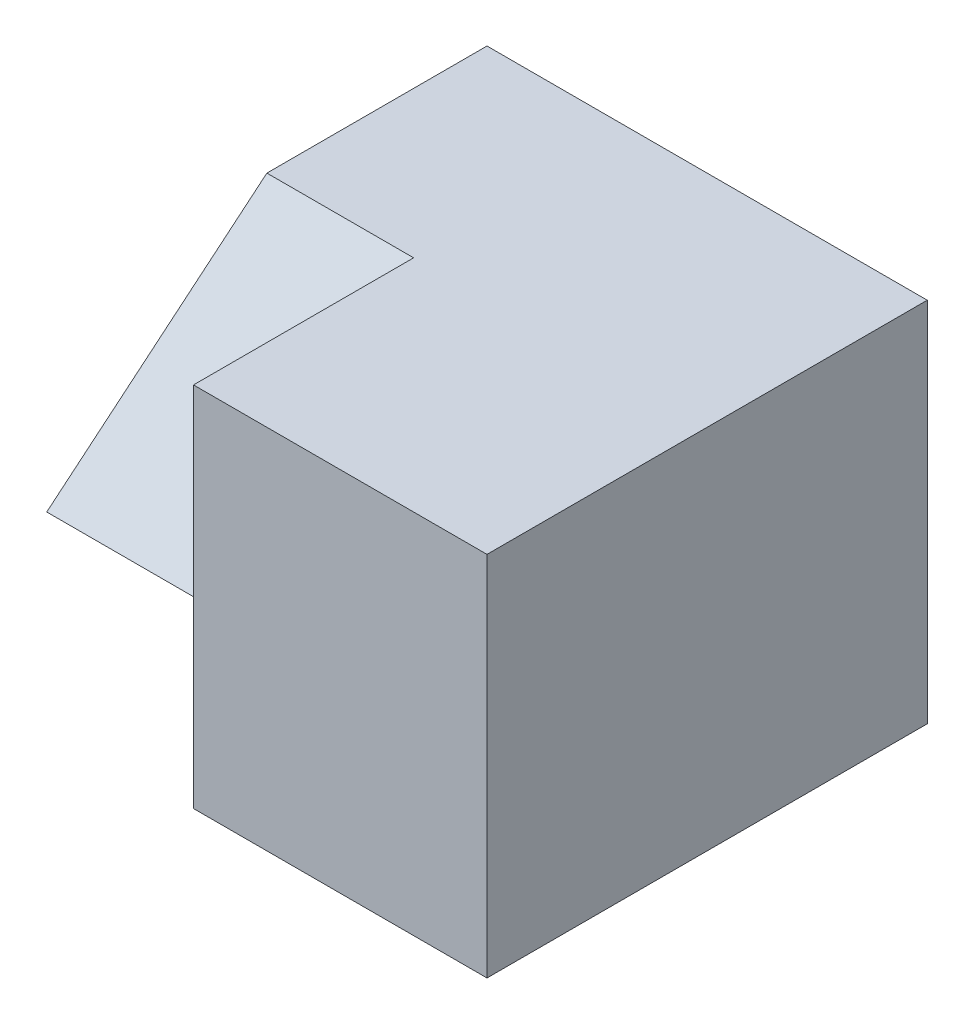
ISO-10303-21;
HEADER;
FILE_DESCRIPTION(('STEP AP214'),'2;1');
FILE_NAME('part.step','',(''),(''),'','','');
FILE_SCHEMA(('AUTOMOTIVE_DESIGN { 1 0 10303 214 1 1 1 1 }'));
ENDSEC;
DATA;
#1=APPLICATION_CONTEXT('core data for automotive mechanical design processes');
#2=APPLICATION_PROTOCOL_DEFINITION('international standard','automotive_design',2000,#1);
#3=PRODUCT_CONTEXT('',#1,'mechanical');
#4=PRODUCT('Part','Part','',(#3));
#5=PRODUCT_RELATED_PRODUCT_CATEGORY('part','',(#4));
#6=PRODUCT_DEFINITION_FORMATION('','',#4);
#7=PRODUCT_DEFINITION_CONTEXT('part definition',#1,'design');
#8=PRODUCT_DEFINITION('design','',#6,#7);
#9=PRODUCT_DEFINITION_SHAPE('','',#8);
#10=(LENGTH_UNIT() NAMED_UNIT(*) SI_UNIT(.MILLI.,.METRE.));
#11=(NAMED_UNIT(*) PLANE_ANGLE_UNIT() SI_UNIT($,.RADIAN.));
#12=(NAMED_UNIT(*) SI_UNIT($,.STERADIAN.) SOLID_ANGLE_UNIT());
#13=UNCERTAINTY_MEASURE_WITH_UNIT(LENGTH_MEASURE(1.E-05),#10,'distance_accuracy_value','');
#14=(GEOMETRIC_REPRESENTATION_CONTEXT(3) GLOBAL_UNCERTAINTY_ASSIGNED_CONTEXT((#13)) GLOBAL_UNIT_ASSIGNED_CONTEXT((#10,
#11,#12)) REPRESENTATION_CONTEXT('',''));
#15=CARTESIAN_POINT('',(0.,0.,0.));
#16=DIRECTION('',(0.,0.,1.));
#17=DIRECTION('',(1.,0.,0.));
#18=AXIS2_PLACEMENT_3D('',#15,#16,#17);
#19=CARTESIAN_POINT('',(-3.,5.,3.));
#20=DIRECTION('',(0.,0.,-1.));
#21=DIRECTION('',(-1.,0.,0.));
#22=AXIS2_PLACEMENT_3D('',#19,#20,#21);
#23=PLANE('',#22);
#24=DIRECTION('',(0.,1.,0.));
#25=VECTOR('',#24,1.);
#26=CARTESIAN_POINT('',(-1.,0.,3.));
#27=LINE('',#26,#25);
#28=CARTESIAN_POINT('',(-1.,0.,3.));
#29=VERTEX_POINT('',#28);
#30=CARTESIAN_POINT('',(-1.,2.5,3.));
#31=VERTEX_POINT('',#30);
#32=EDGE_CURVE('E119',#29,#31,#27,.T.);
#33=ORIENTED_EDGE('',*,*,#32,.F.);
#34=DIRECTION('',(1.,0.,0.));
#35=VECTOR('',#34,1.);
#36=CARTESIAN_POINT('',(-3.,0.,3.));
#37=LINE('',#36,#35);
#38=CARTESIAN_POINT('',(3.,0.,3.));
#39=VERTEX_POINT('',#38);
#40=EDGE_CURVE('E74',#29,#39,#37,.T.);
#41=ORIENTED_EDGE('',*,*,#40,.T.);
#42=DIRECTION('',(0.,-1.,0.));
#43=VECTOR('',#42,1.);
#44=CARTESIAN_POINT('',(3.,5.,3.));
#45=LINE('',#44,#43);
#46=CARTESIAN_POINT('',(3.,5.,3.));
#47=VERTEX_POINT('',#46);
#48=EDGE_CURVE('E146',#47,#39,#45,.T.);
#49=ORIENTED_EDGE('',*,*,#48,.F.);
#50=DIRECTION('',(1.,0.,0.));
#51=VECTOR('',#50,1.);
#52=CARTESIAN_POINT('',(-3.,5.,3.));
#53=LINE('',#52,#51);
#54=CARTESIAN_POINT('',(-1.,5.,3.));
#55=VERTEX_POINT('',#54);
#56=EDGE_CURVE('E56',#55,#47,#53,.T.);
#57=ORIENTED_EDGE('',*,*,#56,.F.);
#58=DIRECTION('',(0.,1.,0.));
#59=VECTOR('',#58,1.);
#60=CARTESIAN_POINT('',(-1.,0.,3.));
#61=LINE('',#60,#59);
#62=EDGE_CURVE('E48',#31,#55,#61,.T.);
#63=ORIENTED_EDGE('',*,*,#62,.F.);
#64=EDGE_LOOP('',(#33,#41,#49,#57,#63));
#65=FACE_BOUND('',#64,.T.);
#66=ADVANCED_FACE('F33',(#65),#23,.F.);
#67=CARTESIAN_POINT('',(3.,5.,3.));
#68=DIRECTION('',(-1.,0.,0.));
#69=DIRECTION('',(0.,0.,1.));
#70=AXIS2_PLACEMENT_3D('',#67,#68,#69);
#71=PLANE('',#70);
#72=DIRECTION('',(0.,0.,-1.));
#73=VECTOR('',#72,1.);
#74=CARTESIAN_POINT('',(3.,0.,3.));
#75=LINE('',#74,#73);
#76=CARTESIAN_POINT('',(3.,0.,-3.));
#77=VERTEX_POINT('',#76);
#78=EDGE_CURVE('E137',#39,#77,#75,.T.);
#79=ORIENTED_EDGE('',*,*,#78,.T.);
#80=DIRECTION('',(0.,-1.,0.));
#81=VECTOR('',#80,1.);
#82=CARTESIAN_POINT('',(3.,5.,-3.));
#83=LINE('',#82,#81);
#84=CARTESIAN_POINT('',(3.,5.,-3.));
#85=VERTEX_POINT('',#84);
#86=EDGE_CURVE('E11',#85,#77,#83,.T.);
#87=ORIENTED_EDGE('',*,*,#86,.F.);
#88=DIRECTION('',(0.,0.,-1.));
#89=VECTOR('',#88,1.);
#90=CARTESIAN_POINT('',(3.,5.,3.));
#91=LINE('',#90,#89);
#92=EDGE_CURVE('E139',#47,#85,#91,.T.);
#93=ORIENTED_EDGE('',*,*,#92,.F.);
#94=ORIENTED_EDGE('',*,*,#48,.T.);
#95=EDGE_LOOP('',(#79,#87,#93,#94));
#96=FACE_BOUND('',#95,.T.);
#97=ADVANCED_FACE('F35',(#96),#71,.F.);
#98=CARTESIAN_POINT('',(-3.,5.,-3.));
#99=DIRECTION('',(0.,0.,1.));
#100=DIRECTION('',(1.,0.,0.));
#101=AXIS2_PLACEMENT_3D('',#98,#99,#100);
#102=PLANE('',#101);
#103=DIRECTION('',(-1.,0.,0.));
#104=VECTOR('',#103,1.);
#105=CARTESIAN_POINT('',(-3.,0.,-3.));
#106=LINE('',#105,#104);
#107=CARTESIAN_POINT('',(-3.,0.,-3.));
#108=VERTEX_POINT('',#107);
#109=EDGE_CURVE('E149',#77,#108,#106,.T.);
#110=ORIENTED_EDGE('',*,*,#109,.T.);
#111=DIRECTION('',(0.,-1.,0.));
#112=VECTOR('',#111,1.);
#113=CARTESIAN_POINT('',(-3.,5.,-3.));
#114=LINE('',#113,#112);
#115=CARTESIAN_POINT('',(-3.,5.,-3.));
#116=VERTEX_POINT('',#115);
#117=EDGE_CURVE('E41',#116,#108,#114,.T.);
#118=ORIENTED_EDGE('',*,*,#117,.F.);
#119=DIRECTION('',(-1.,0.,0.));
#120=VECTOR('',#119,1.);
#121=CARTESIAN_POINT('',(-3.,5.,-3.));
#122=LINE('',#121,#120);
#123=EDGE_CURVE('E79',#85,#116,#122,.T.);
#124=ORIENTED_EDGE('',*,*,#123,.F.);
#125=ORIENTED_EDGE('',*,*,#86,.T.);
#126=EDGE_LOOP('',(#110,#118,#124,#125));
#127=FACE_BOUND('',#126,.T.);
#128=ADVANCED_FACE('F160',(#127),#102,.F.);
#129=CARTESIAN_POINT('',(-3.,5.,3.));
#130=DIRECTION('',(1.,0.,0.));
#131=DIRECTION('',(0.,0.,-1.));
#132=AXIS2_PLACEMENT_3D('',#129,#130,#131);
#133=PLANE('',#132);
#134=DIRECTION('',(0.,0.,1.));
#135=VECTOR('',#134,1.);
#136=CARTESIAN_POINT('',(-3.,0.,3.));
#137=LINE('',#136,#135);
#138=CARTESIAN_POINT('',(-3.,0.,0.));
#139=VERTEX_POINT('',#138);
#140=EDGE_CURVE('E151',#108,#139,#137,.T.);
#141=ORIENTED_EDGE('',*,*,#140,.T.);
#142=DIRECTION('',(0.,-0.64018439966448,-0.768221279597376));
#143=VECTOR('',#142,1.);
#144=CARTESIAN_POINT('',(-3.,0.,0.));
#145=LINE('',#144,#143);
#146=CARTESIAN_POINT('',(-3.,2.5,3.));
#147=VERTEX_POINT('',#146);
#148=EDGE_CURVE('E109',#147,#139,#145,.T.);
#149=ORIENTED_EDGE('',*,*,#148,.F.);
#150=DIRECTION('',(0.,-0.64018439966448,0.768221279597376));
#151=VECTOR('',#150,1.);
#152=CARTESIAN_POINT('',(-3.,2.95081967213115,2.45901639344262));
#153=LINE('',#152,#151);
#154=CARTESIAN_POINT('',(-3.,5.,0.));
#155=VERTEX_POINT('',#154);
#156=EDGE_CURVE('E114',#155,#147,#153,.T.);
#157=ORIENTED_EDGE('',*,*,#156,.F.);
#158=DIRECTION('',(0.,0.,1.));
#159=VECTOR('',#158,1.);
#160=CARTESIAN_POINT('',(-3.,5.,3.));
#161=LINE('',#160,#159);
#162=EDGE_CURVE('E142',#116,#155,#161,.T.);
#163=ORIENTED_EDGE('',*,*,#162,.F.);
#164=ORIENTED_EDGE('',*,*,#117,.T.);
#165=EDGE_LOOP('',(#141,#149,#157,#163,#164));
#166=FACE_BOUND('',#165,.T.);
#167=ADVANCED_FACE('F157',(#166),#133,.F.);
#168=CARTESIAN_POINT('',(0.,5.,0.));
#169=DIRECTION('',(0.,-1.,0.));
#170=DIRECTION('',(0.,0.,-1.));
#171=AXIS2_PLACEMENT_3D('',#168,#169,#170);
#172=PLANE('',#171);
#173=ORIENTED_EDGE('',*,*,#162,.T.);
#174=DIRECTION('',(-1.,0.,0.));
#175=VECTOR('',#174,1.);
#176=CARTESIAN_POINT('',(-1.,5.,0.));
#177=LINE('',#176,#175);
#178=CARTESIAN_POINT('',(-1.,5.,0.));
#179=VERTEX_POINT('',#178);
#180=EDGE_CURVE('E132',#179,#155,#177,.T.);
#181=ORIENTED_EDGE('',*,*,#180,.F.);
#182=DIRECTION('',(0.,0.,-1.));
#183=VECTOR('',#182,1.);
#184=CARTESIAN_POINT('',(-1.,5.,0.));
#185=LINE('',#184,#183);
#186=EDGE_CURVE('E127',#55,#179,#185,.T.);
#187=ORIENTED_EDGE('',*,*,#186,.F.);
#188=ORIENTED_EDGE('',*,*,#56,.T.);
#189=ORIENTED_EDGE('',*,*,#92,.T.);
#190=ORIENTED_EDGE('',*,*,#123,.T.);
#191=EDGE_LOOP('',(#173,#181,#187,#188,#189,#190));
#192=FACE_BOUND('',#191,.T.);
#193=ADVANCED_FACE('F172',(#192),#172,.F.);
#194=CARTESIAN_POINT('',(0.,0.,0.));
#195=DIRECTION('',(0.,-1.,0.));
#196=DIRECTION('',(0.,0.,-1.));
#197=AXIS2_PLACEMENT_3D('',#194,#195,#196);
#198=PLANE('',#197);
#199=DIRECTION('',(-1.,0.,0.));
#200=VECTOR('',#199,1.);
#201=CARTESIAN_POINT('',(-1.,0.,0.));
#202=LINE('',#201,#200);
#203=CARTESIAN_POINT('',(-1.,0.,0.));
#204=VERTEX_POINT('',#203);
#205=EDGE_CURVE('E103',#204,#139,#202,.T.);
#206=ORIENTED_EDGE('',*,*,#205,.T.);
#207=ORIENTED_EDGE('',*,*,#140,.F.);
#208=ORIENTED_EDGE('',*,*,#109,.F.);
#209=ORIENTED_EDGE('',*,*,#78,.F.);
#210=ORIENTED_EDGE('',*,*,#40,.F.);
#211=DIRECTION('',(0.,0.,1.));
#212=VECTOR('',#211,1.);
#213=CARTESIAN_POINT('',(-1.,0.,0.));
#214=LINE('',#213,#212);
#215=EDGE_CURVE('E115',#204,#29,#214,.T.);
#216=ORIENTED_EDGE('',*,*,#215,.F.);
#217=EDGE_LOOP('',(#206,#207,#208,#209,#210,#216));
#218=FACE_BOUND('',#217,.T.);
#219=ADVANCED_FACE('F121',(#218),#198,.T.);
#220=CARTESIAN_POINT('',(-1.,2.95081967213115,2.45901639344262));
#221=DIRECTION('',(0.,-0.768221279597376,-0.64018439966448));
#222=DIRECTION('',(0.,0.64018439966448,-0.768221279597376));
#223=AXIS2_PLACEMENT_3D('',#220,#221,#222);
#224=PLANE('',#223);
#225=ORIENTED_EDGE('',*,*,#156,.T.);
#226=DIRECTION('',(-1.,0.,0.));
#227=VECTOR('',#226,1.);
#228=CARTESIAN_POINT('',(-1.,2.5,3.));
#229=LINE('',#228,#227);
#230=EDGE_CURVE('E135',#31,#147,#229,.T.);
#231=ORIENTED_EDGE('',*,*,#230,.F.);
#232=DIRECTION('',(0.,-0.64018439966448,0.768221279597376));
#233=VECTOR('',#232,1.);
#234=CARTESIAN_POINT('',(-1.,2.95081967213115,2.45901639344262));
#235=LINE('',#234,#233);
#236=EDGE_CURVE('E129',#179,#31,#235,.T.);
#237=ORIENTED_EDGE('',*,*,#236,.F.);
#238=ORIENTED_EDGE('',*,*,#180,.T.);
#239=EDGE_LOOP('',(#225,#231,#237,#238));
#240=FACE_BOUND('',#239,.T.);
#241=ADVANCED_FACE('F193',(#240),#224,.F.);
#242=CARTESIAN_POINT('',(-1.,0.,0.));
#243=DIRECTION('',(-1.,0.,0.));
#244=DIRECTION('',(0.,0.,1.));
#245=AXIS2_PLACEMENT_3D('',#242,#243,#244);
#246=PLANE('',#245);
#247=ORIENTED_EDGE('',*,*,#186,.T.);
#248=ORIENTED_EDGE('',*,*,#236,.T.);
#249=ORIENTED_EDGE('',*,*,#62,.T.);
#250=EDGE_LOOP('',(#247,#248,#249));
#251=FACE_BOUND('',#250,.T.);
#252=ADVANCED_FACE('F199',(#251),#246,.T.);
#253=CARTESIAN_POINT('',(-1.,0.,0.));
#254=DIRECTION('',(0.,0.768221279597376,-0.64018439966448));
#255=DIRECTION('',(0.,0.64018439966448,0.768221279597376));
#256=AXIS2_PLACEMENT_3D('',#253,#254,#255);
#257=PLANE('',#256);
#258=ORIENTED_EDGE('',*,*,#148,.T.);
#259=ORIENTED_EDGE('',*,*,#205,.F.);
#260=DIRECTION('',(0.,-0.64018439966448,-0.768221279597376));
#261=VECTOR('',#260,1.);
#262=CARTESIAN_POINT('',(-1.,0.,0.));
#263=LINE('',#262,#261);
#264=EDGE_CURVE('E106',#31,#204,#263,.T.);
#265=ORIENTED_EDGE('',*,*,#264,.F.);
#266=ORIENTED_EDGE('',*,*,#230,.T.);
#267=EDGE_LOOP('',(#258,#259,#265,#266));
#268=FACE_BOUND('',#267,.T.);
#269=ADVANCED_FACE('F105',(#268),#257,.F.);
#270=CARTESIAN_POINT('',(-1.,0.,0.));
#271=DIRECTION('',(-1.,0.,0.));
#272=DIRECTION('',(0.,0.,1.));
#273=AXIS2_PLACEMENT_3D('',#270,#271,#272);
#274=PLANE('',#273);
#275=ORIENTED_EDGE('',*,*,#32,.T.);
#276=ORIENTED_EDGE('',*,*,#264,.T.);
#277=ORIENTED_EDGE('',*,*,#215,.T.);
#278=EDGE_LOOP('',(#275,#276,#277));
#279=FACE_BOUND('',#278,.T.);
#280=ADVANCED_FACE('F118',(#279),#274,.T.);
#281=CLOSED_SHELL('',(#66,#97,#128,#167,#193,#219,#241,#252,#269,#280));
#282=MANIFOLD_SOLID_BREP('B2',#281);
#283=ADVANCED_BREP_SHAPE_REPRESENTATION('',(#18,#282),#14);
#284=SHAPE_DEFINITION_REPRESENTATION(#9,#283);
ENDSEC;
END-ISO-10303-21;
